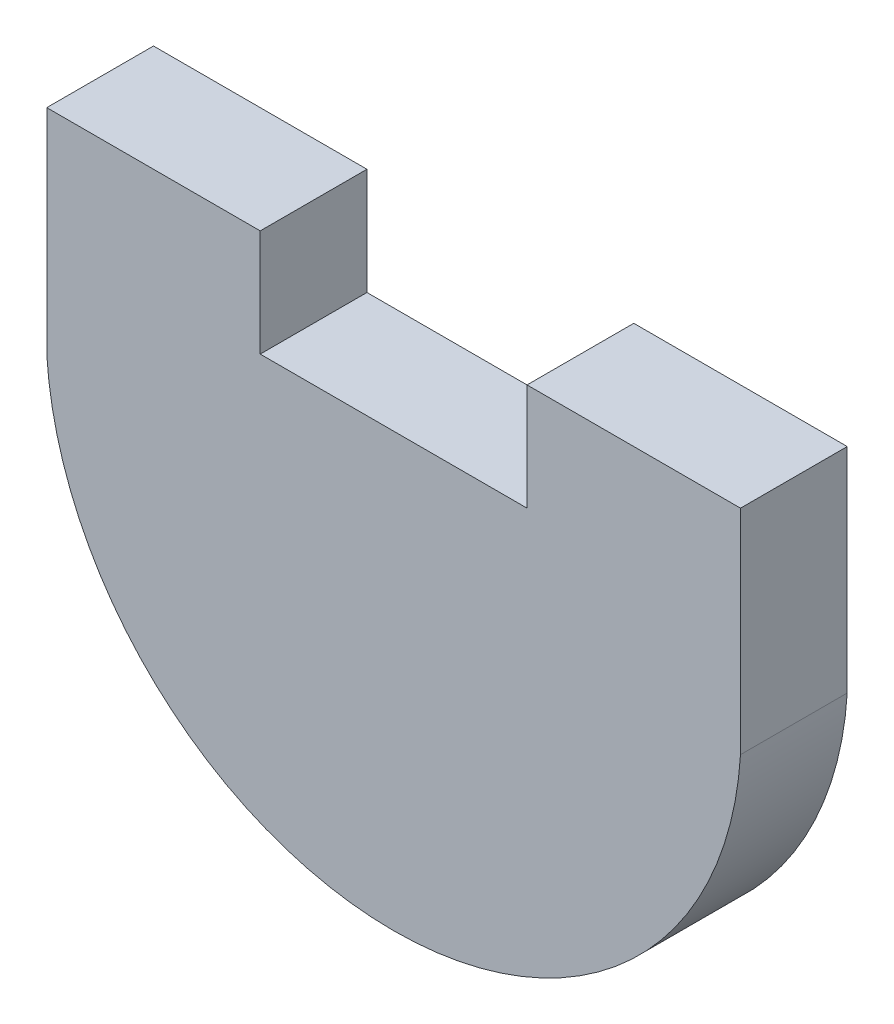
ISO-10303-21;
HEADER;
FILE_DESCRIPTION(('STEP AP214'),'2;1');
FILE_NAME('part.step','',(''),(''),'','','');
FILE_SCHEMA(('AUTOMOTIVE_DESIGN { 1 0 10303 214 1 1 1 1 }'));
ENDSEC;
DATA;
#1=APPLICATION_CONTEXT('core data for automotive mechanical design processes');
#2=APPLICATION_PROTOCOL_DEFINITION('international standard','automotive_design',2000,#1);
#3=PRODUCT_CONTEXT('',#1,'mechanical');
#4=PRODUCT('Part','Part','',(#3));
#5=PRODUCT_RELATED_PRODUCT_CATEGORY('part','',(#4));
#6=PRODUCT_DEFINITION_FORMATION('','',#4);
#7=PRODUCT_DEFINITION_CONTEXT('part definition',#1,'design');
#8=PRODUCT_DEFINITION('design','',#6,#7);
#9=PRODUCT_DEFINITION_SHAPE('','',#8);
#10=(LENGTH_UNIT() NAMED_UNIT(*) SI_UNIT(.MILLI.,.METRE.));
#11=(NAMED_UNIT(*) PLANE_ANGLE_UNIT() SI_UNIT($,.RADIAN.));
#12=(NAMED_UNIT(*) SI_UNIT($,.STERADIAN.) SOLID_ANGLE_UNIT());
#13=UNCERTAINTY_MEASURE_WITH_UNIT(LENGTH_MEASURE(1.E-05),#10,'distance_accuracy_value','');
#14=(GEOMETRIC_REPRESENTATION_CONTEXT(3) GLOBAL_UNCERTAINTY_ASSIGNED_CONTEXT((#13)) GLOBAL_UNIT_ASSIGNED_CONTEXT((#10,
#11,#12)) REPRESENTATION_CONTEXT('',''));
#15=CARTESIAN_POINT('',(0.,0.,0.));
#16=DIRECTION('',(0.,0.,1.));
#17=DIRECTION('',(1.,0.,0.));
#18=AXIS2_PLACEMENT_3D('',#15,#16,#17);
#19=CARTESIAN_POINT('',(-16.51,12.7,5.08));
#20=DIRECTION('',(0.,-1.,0.));
#21=DIRECTION('',(0.,0.,-1.));
#22=AXIS2_PLACEMENT_3D('',#19,#20,#21);
#23=PLANE('',#22);
#24=DIRECTION('',(-1.,0.,0.));
#25=VECTOR('',#24,1.);
#26=CARTESIAN_POINT('',(-16.51,12.7,5.08));
#27=LINE('',#26,#25);
#28=CARTESIAN_POINT('',(-6.35,12.7,5.08));
#29=VERTEX_POINT('',#28);
#30=CARTESIAN_POINT('',(-16.51,12.7,5.08));
#31=VERTEX_POINT('',#30);
#32=EDGE_CURVE('E57',#29,#31,#27,.T.);
#33=ORIENTED_EDGE('',*,*,#32,.F.);
#34=DIRECTION('',(0.,0.,1.));
#35=VECTOR('',#34,1.);
#36=CARTESIAN_POINT('',(-6.35,12.7,-13.6783186101216));
#37=LINE('',#36,#35);
#38=CARTESIAN_POINT('',(-6.35,12.7,0.));
#39=VERTEX_POINT('',#38);
#40=EDGE_CURVE('E120',#39,#29,#37,.T.);
#41=ORIENTED_EDGE('',*,*,#40,.F.);
#42=DIRECTION('',(-1.,0.,0.));
#43=VECTOR('',#42,1.);
#44=CARTESIAN_POINT('',(-16.51,12.7,0.));
#45=LINE('',#44,#43);
#46=CARTESIAN_POINT('',(-16.51,12.7,0.));
#47=VERTEX_POINT('',#46);
#48=EDGE_CURVE('E79',#39,#47,#45,.T.);
#49=ORIENTED_EDGE('',*,*,#48,.T.);
#50=DIRECTION('',(0.,0.,-1.));
#51=VECTOR('',#50,1.);
#52=CARTESIAN_POINT('',(-16.51,12.7,5.08));
#53=LINE('',#52,#51);
#54=EDGE_CURVE('E145',#31,#47,#53,.T.);
#55=ORIENTED_EDGE('',*,*,#54,.F.);
#56=EDGE_LOOP('',(#33,#41,#49,#55));
#57=FACE_BOUND('',#56,.T.);
#58=ADVANCED_FACE('F33',(#57),#23,.F.);
#59=CARTESIAN_POINT('',(-16.51,12.7,5.08));
#60=DIRECTION('',(1.,0.,0.));
#61=DIRECTION('',(0.,0.,-1.));
#62=AXIS2_PLACEMENT_3D('',#59,#60,#61);
#63=PLANE('',#62);
#64=DIRECTION('',(0.,-1.,0.));
#65=VECTOR('',#64,1.);
#66=CARTESIAN_POINT('',(-16.51,12.7,0.));
#67=LINE('',#66,#65);
#68=CARTESIAN_POINT('',(-16.51,2.54000000000011,0.));
#69=VERTEX_POINT('',#68);
#70=EDGE_CURVE('E135',#47,#69,#67,.T.);
#71=ORIENTED_EDGE('',*,*,#70,.T.);
#72=DIRECTION('',(0.,0.,-1.));
#73=VECTOR('',#72,1.);
#74=CARTESIAN_POINT('',(-16.51,2.54000000000011,5.08));
#75=LINE('',#74,#73);
#76=CARTESIAN_POINT('',(-16.51,2.54000000000011,5.08));
#77=VERTEX_POINT('',#76);
#78=EDGE_CURVE('E11',#77,#69,#75,.T.);
#79=ORIENTED_EDGE('',*,*,#78,.F.);
#80=DIRECTION('',(0.,-1.,0.));
#81=VECTOR('',#80,1.);
#82=CARTESIAN_POINT('',(-16.51,12.7,5.08));
#83=LINE('',#82,#81);
#84=EDGE_CURVE('E137',#31,#77,#83,.T.);
#85=ORIENTED_EDGE('',*,*,#84,.F.);
#86=ORIENTED_EDGE('',*,*,#54,.T.);
#87=EDGE_LOOP('',(#71,#79,#85,#86));
#88=FACE_BOUND('',#87,.T.);
#89=ADVANCED_FACE('F35',(#88),#63,.F.);
#90=CARTESIAN_POINT('',(0.,3.56720117449487,5.08));
#91=DIRECTION('',(0.,0.,-1.));
#92=DIRECTION('',(-1.,0.,0.));
#93=AXIS2_PLACEMENT_3D('',#90,#91,#92);
#94=CYLINDRICAL_SURFACE('',#93,16.5419237772662);
#95=CARTESIAN_POINT('',(0.,3.56720117449487,0.));
#96=DIRECTION('',(0.,0.,1.));
#97=DIRECTION('',(1.,0.,0.));
#98=AXIS2_PLACEMENT_3D('',#95,#96,#97);
#99=CIRCLE('',#98,16.5419237772662);
#100=CARTESIAN_POINT('',(16.51,2.54000000000011,0.));
#101=VERTEX_POINT('',#100);
#102=EDGE_CURVE('E148',#69,#101,#99,.T.);
#103=ORIENTED_EDGE('',*,*,#102,.T.);
#104=DIRECTION('',(0.,0.,-1.));
#105=VECTOR('',#104,1.);
#106=CARTESIAN_POINT('',(16.51,2.54000000000011,5.08));
#107=LINE('',#106,#105);
#108=CARTESIAN_POINT('',(16.51,2.54000000000011,5.08));
#109=VERTEX_POINT('',#108);
#110=EDGE_CURVE('E41',#109,#101,#107,.T.);
#111=ORIENTED_EDGE('',*,*,#110,.F.);
#112=CARTESIAN_POINT('',(0.,3.56720117449487,5.08));
#113=DIRECTION('',(0.,0.,1.));
#114=DIRECTION('',(1.,0.,0.));
#115=AXIS2_PLACEMENT_3D('',#112,#113,#114);
#116=CIRCLE('',#115,16.5419237772662);
#117=EDGE_CURVE('E86',#77,#109,#116,.T.);
#118=ORIENTED_EDGE('',*,*,#117,.F.);
#119=ORIENTED_EDGE('',*,*,#78,.T.);
#120=EDGE_LOOP('',(#103,#111,#118,#119));
#121=FACE_BOUND('',#120,.T.);
#122=ADVANCED_FACE('F174',(#121),#94,.T.);
#123=CARTESIAN_POINT('',(16.51,12.7,5.08));
#124=DIRECTION('',(-1.,0.,0.));
#125=DIRECTION('',(0.,0.,1.));
#126=AXIS2_PLACEMENT_3D('',#123,#124,#125);
#127=PLANE('',#126);
#128=DIRECTION('',(0.,1.,0.));
#129=VECTOR('',#128,1.);
#130=CARTESIAN_POINT('',(16.51,12.7,0.));
#131=LINE('',#130,#129);
#132=CARTESIAN_POINT('',(16.51,12.7,0.));
#133=VERTEX_POINT('',#132);
#134=EDGE_CURVE('E150',#101,#133,#131,.T.);
#135=ORIENTED_EDGE('',*,*,#134,.T.);
#136=DIRECTION('',(0.,0.,-1.));
#137=VECTOR('',#136,1.);
#138=CARTESIAN_POINT('',(16.51,12.7,5.08));
#139=LINE('',#138,#137);
#140=CARTESIAN_POINT('',(16.51,12.7,5.08));
#141=VERTEX_POINT('',#140);
#142=EDGE_CURVE('E155',#141,#133,#139,.T.);
#143=ORIENTED_EDGE('',*,*,#142,.F.);
#144=DIRECTION('',(0.,1.,0.));
#145=VECTOR('',#144,1.);
#146=CARTESIAN_POINT('',(16.51,12.7,5.08));
#147=LINE('',#146,#145);
#148=EDGE_CURVE('E141',#109,#141,#147,.T.);
#149=ORIENTED_EDGE('',*,*,#148,.F.);
#150=ORIENTED_EDGE('',*,*,#110,.T.);
#151=EDGE_LOOP('',(#135,#143,#149,#150));
#152=FACE_BOUND('',#151,.T.);
#153=ADVANCED_FACE('F161',(#152),#127,.F.);
#154=CARTESIAN_POINT('',(6.35,12.7,0.));
#155=VERTEX_POINT('',#154);
#156=EDGE_CURVE('E139',#133,#155,#45,.T.);
#157=ORIENTED_EDGE('',*,*,#156,.T.);
#158=DIRECTION('',(0.,0.,1.));
#159=VECTOR('',#158,1.);
#160=CARTESIAN_POINT('',(6.35,12.7,-13.6783186101216));
#161=LINE('',#160,#159);
#162=CARTESIAN_POINT('',(6.35,12.7,5.08));
#163=VERTEX_POINT('',#162);
#164=EDGE_CURVE('E130',#155,#163,#161,.T.);
#165=ORIENTED_EDGE('',*,*,#164,.T.);
#166=EDGE_CURVE('E143',#141,#163,#27,.T.);
#167=ORIENTED_EDGE('',*,*,#166,.F.);
#168=ORIENTED_EDGE('',*,*,#142,.T.);
#169=EDGE_LOOP('',(#157,#165,#167,#168));
#170=FACE_BOUND('',#169,.T.);
#171=ADVANCED_FACE('F169',(#170),#23,.F.);
#172=CARTESIAN_POINT('',(0.,3.56720117449487,5.08));
#173=DIRECTION('',(0.,0.,1.));
#174=DIRECTION('',(1.,0.,0.));
#175=AXIS2_PLACEMENT_3D('',#172,#173,#174);
#176=PLANE('',#175);
#177=DIRECTION('',(0.,-1.,0.));
#178=VECTOR('',#177,1.);
#179=CARTESIAN_POINT('',(-6.35,12.7,5.08));
#180=LINE('',#179,#178);
#181=CARTESIAN_POINT('',(-6.35,7.62,5.08));
#182=VERTEX_POINT('',#181);
#183=EDGE_CURVE('E118',#29,#182,#180,.T.);
#184=ORIENTED_EDGE('',*,*,#183,.F.);
#185=ORIENTED_EDGE('',*,*,#32,.T.);
#186=ORIENTED_EDGE('',*,*,#84,.T.);
#187=ORIENTED_EDGE('',*,*,#117,.T.);
#188=ORIENTED_EDGE('',*,*,#148,.T.);
#189=ORIENTED_EDGE('',*,*,#166,.T.);
#190=DIRECTION('',(0.,1.,0.));
#191=VECTOR('',#190,1.);
#192=CARTESIAN_POINT('',(6.35,12.7,5.08));
#193=LINE('',#192,#191);
#194=CARTESIAN_POINT('',(6.35,7.62,5.08));
#195=VERTEX_POINT('',#194);
#196=EDGE_CURVE('E116',#195,#163,#193,.T.);
#197=ORIENTED_EDGE('',*,*,#196,.F.);
#198=DIRECTION('',(1.,0.,0.));
#199=VECTOR('',#198,1.);
#200=CARTESIAN_POINT('',(-6.35,7.62,5.08));
#201=LINE('',#200,#199);
#202=EDGE_CURVE('E110',#182,#195,#201,.T.);
#203=ORIENTED_EDGE('',*,*,#202,.F.);
#204=EDGE_LOOP('',(#184,#185,#186,#187,#188,#189,#197,#203));
#205=FACE_BOUND('',#204,.T.);
#206=ADVANCED_FACE('F122',(#205),#176,.T.);
#207=CARTESIAN_POINT('',(0.,3.56720117449487,0.));
#208=DIRECTION('',(0.,0.,1.));
#209=DIRECTION('',(1.,0.,0.));
#210=AXIS2_PLACEMENT_3D('',#207,#208,#209);
#211=PLANE('',#210);
#212=ORIENTED_EDGE('',*,*,#48,.F.);
#213=DIRECTION('',(0.,1.,0.));
#214=VECTOR('',#213,1.);
#215=CARTESIAN_POINT('',(-6.35,12.7,0.));
#216=LINE('',#215,#214);
#217=CARTESIAN_POINT('',(-6.35,7.62,0.));
#218=VERTEX_POINT('',#217);
#219=EDGE_CURVE('E136',#218,#39,#216,.T.);
#220=ORIENTED_EDGE('',*,*,#219,.F.);
#221=DIRECTION('',(-1.,0.,0.));
#222=VECTOR('',#221,1.);
#223=CARTESIAN_POINT('',(-6.35,7.62,0.));
#224=LINE('',#223,#222);
#225=CARTESIAN_POINT('',(6.35,7.62,0.));
#226=VERTEX_POINT('',#225);
#227=EDGE_CURVE('E113',#226,#218,#224,.T.);
#228=ORIENTED_EDGE('',*,*,#227,.F.);
#229=DIRECTION('',(0.,-1.,0.));
#230=VECTOR('',#229,1.);
#231=CARTESIAN_POINT('',(6.35,12.7,0.));
#232=LINE('',#231,#230);
#233=EDGE_CURVE('E129',#155,#226,#232,.T.);
#234=ORIENTED_EDGE('',*,*,#233,.F.);
#235=ORIENTED_EDGE('',*,*,#156,.F.);
#236=ORIENTED_EDGE('',*,*,#134,.F.);
#237=ORIENTED_EDGE('',*,*,#102,.F.);
#238=ORIENTED_EDGE('',*,*,#70,.F.);
#239=EDGE_LOOP('',(#212,#220,#228,#234,#235,#236,#237,#238));
#240=FACE_BOUND('',#239,.T.);
#241=ADVANCED_FACE('F165',(#240),#211,.F.);
#242=CARTESIAN_POINT('',(-6.35,12.7,-13.6783186101216));
#243=DIRECTION('',(-1.,0.,0.));
#244=DIRECTION('',(0.,0.,1.));
#245=AXIS2_PLACEMENT_3D('',#242,#243,#244);
#246=PLANE('',#245);
#247=ORIENTED_EDGE('',*,*,#219,.T.);
#248=ORIENTED_EDGE('',*,*,#40,.T.);
#249=ORIENTED_EDGE('',*,*,#183,.T.);
#250=DIRECTION('',(0.,0.,1.));
#251=VECTOR('',#250,1.);
#252=CARTESIAN_POINT('',(-6.35,7.62,-13.6783186101216));
#253=LINE('',#252,#251);
#254=EDGE_CURVE('E106',#218,#182,#253,.T.);
#255=ORIENTED_EDGE('',*,*,#254,.F.);
#256=EDGE_LOOP('',(#247,#248,#249,#255));
#257=FACE_BOUND('',#256,.T.);
#258=ADVANCED_FACE('F119',(#257),#246,.F.);
#259=CARTESIAN_POINT('',(6.35,12.7,-13.6783186101216));
#260=DIRECTION('',(1.,0.,0.));
#261=DIRECTION('',(0.,0.,-1.));
#262=AXIS2_PLACEMENT_3D('',#259,#260,#261);
#263=PLANE('',#262);
#264=ORIENTED_EDGE('',*,*,#233,.T.);
#265=DIRECTION('',(0.,0.,1.));
#266=VECTOR('',#265,1.);
#267=CARTESIAN_POINT('',(6.35,7.62,-13.6783186101216));
#268=LINE('',#267,#266);
#269=EDGE_CURVE('E48',#226,#195,#268,.T.);
#270=ORIENTED_EDGE('',*,*,#269,.T.);
#271=ORIENTED_EDGE('',*,*,#196,.T.);
#272=ORIENTED_EDGE('',*,*,#164,.F.);
#273=EDGE_LOOP('',(#264,#270,#271,#272));
#274=FACE_BOUND('',#273,.T.);
#275=ADVANCED_FACE('F197',(#274),#263,.F.);
#276=CARTESIAN_POINT('',(-6.35,7.62,-13.6783186101216));
#277=DIRECTION('',(0.,-1.,0.));
#278=DIRECTION('',(0.,0.,-1.));
#279=AXIS2_PLACEMENT_3D('',#276,#277,#278);
#280=PLANE('',#279);
#281=ORIENTED_EDGE('',*,*,#227,.T.);
#282=ORIENTED_EDGE('',*,*,#254,.T.);
#283=ORIENTED_EDGE('',*,*,#202,.T.);
#284=ORIENTED_EDGE('',*,*,#269,.F.);
#285=EDGE_LOOP('',(#281,#282,#283,#284));
#286=FACE_BOUND('',#285,.T.);
#287=ADVANCED_FACE('F108',(#286),#280,.F.);
#288=CLOSED_SHELL('',(#58,#89,#122,#153,#171,#206,#241,#258,#275,#287));
#289=MANIFOLD_SOLID_BREP('B2',#288);
#290=ADVANCED_BREP_SHAPE_REPRESENTATION('',(#18,#289),#14);
#291=SHAPE_DEFINITION_REPRESENTATION(#9,#290);
ENDSEC;
END-ISO-10303-21;
